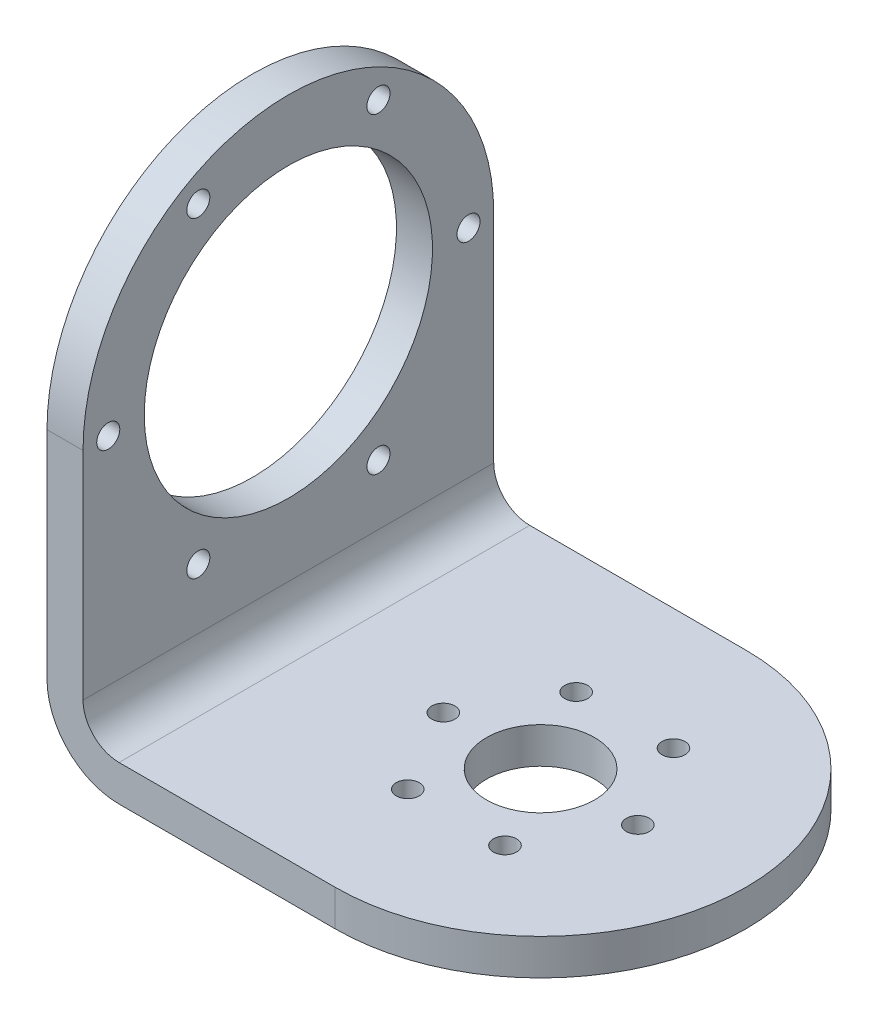
ISO-10303-21;
HEADER;
FILE_DESCRIPTION(('STEP AP214'),'2;1');
FILE_NAME('part.step','',(''),(''),'','','');
FILE_SCHEMA(('AUTOMOTIVE_DESIGN { 1 0 10303 214 1 1 1 1 }'));
ENDSEC;
DATA;
#1=APPLICATION_CONTEXT('core data for automotive mechanical design processes');
#2=APPLICATION_PROTOCOL_DEFINITION('international standard','automotive_design',2000,#1);
#3=PRODUCT_CONTEXT('',#1,'mechanical');
#4=PRODUCT('Part','Part','',(#3));
#5=PRODUCT_RELATED_PRODUCT_CATEGORY('part','',(#4));
#6=PRODUCT_DEFINITION_FORMATION('','',#4);
#7=PRODUCT_DEFINITION_CONTEXT('part definition',#1,'design');
#8=PRODUCT_DEFINITION('design','',#6,#7);
#9=PRODUCT_DEFINITION_SHAPE('','',#8);
#10=(LENGTH_UNIT() NAMED_UNIT(*) SI_UNIT(.MILLI.,.METRE.));
#11=(NAMED_UNIT(*) PLANE_ANGLE_UNIT() SI_UNIT($,.RADIAN.));
#12=(NAMED_UNIT(*) SI_UNIT($,.STERADIAN.) SOLID_ANGLE_UNIT());
#13=UNCERTAINTY_MEASURE_WITH_UNIT(LENGTH_MEASURE(1.E-05),#10,'distance_accuracy_value','');
#14=(GEOMETRIC_REPRESENTATION_CONTEXT(3) GLOBAL_UNCERTAINTY_ASSIGNED_CONTEXT((#13)) GLOBAL_UNIT_ASSIGNED_CONTEXT((#10,
#11,#12)) REPRESENTATION_CONTEXT('',''));
#15=CARTESIAN_POINT('',(0.,0.,0.));
#16=DIRECTION('',(0.,0.,1.));
#17=DIRECTION('',(1.,0.,0.));
#18=AXIS2_PLACEMENT_3D('',#15,#16,#17);
#19=CARTESIAN_POINT('',(0.,5.,28.5));
#20=DIRECTION('',(0.,0.,-1.));
#21=DIRECTION('',(-1.,0.,0.));
#22=AXIS2_PLACEMENT_3D('',#19,#20,#21);
#23=PLANE('',#22);
#24=DIRECTION('',(0.,-1.,0.));
#25=VECTOR('',#24,1.);
#26=CARTESIAN_POINT('',(-40.,5.,28.5));
#27=LINE('',#26,#25);
#28=CARTESIAN_POINT('',(-40.,40.,28.5));
#29=VERTEX_POINT('',#28);
#30=CARTESIAN_POINT('',(-40.,10.,28.5));
#31=VERTEX_POINT('',#30);
#32=EDGE_CURVE('E186',#29,#31,#27,.T.);
#33=ORIENTED_EDGE('',*,*,#32,.T.);
#34=CARTESIAN_POINT('',(-30.,10.,28.5));
#35=DIRECTION('',(0.,0.,-1.));
#36=DIRECTION('',(-1.,0.,0.));
#37=AXIS2_PLACEMENT_3D('',#34,#35,#36);
#38=CIRCLE('',#37,10.);
#39=CARTESIAN_POINT('',(-30.,0.,28.5));
#40=VERTEX_POINT('',#39);
#41=EDGE_CURVE('E205',#31,#40,#38,.F.);
#42=ORIENTED_EDGE('',*,*,#41,.T.);
#43=DIRECTION('',(1.,0.,0.));
#44=VECTOR('',#43,1.);
#45=CARTESIAN_POINT('',(0.,0.,28.5));
#46=LINE('',#45,#44);
#47=CARTESIAN_POINT('',(0.,0.,28.5));
#48=VERTEX_POINT('',#47);
#49=EDGE_CURVE('E177',#40,#48,#46,.T.);
#50=ORIENTED_EDGE('',*,*,#49,.T.);
#51=DIRECTION('',(0.,-1.,0.));
#52=VECTOR('',#51,1.);
#53=CARTESIAN_POINT('',(0.,5.,28.5));
#54=LINE('',#53,#52);
#55=CARTESIAN_POINT('',(0.,5.,28.5));
#56=VERTEX_POINT('',#55);
#57=EDGE_CURVE('E199',#56,#48,#54,.T.);
#58=ORIENTED_EDGE('',*,*,#57,.F.);
#59=DIRECTION('',(1.,0.,0.));
#60=VECTOR('',#59,1.);
#61=CARTESIAN_POINT('',(0.,5.,28.5));
#62=LINE('',#61,#60);
#63=CARTESIAN_POINT('',(-30.,5.,28.5));
#64=VERTEX_POINT('',#63);
#65=EDGE_CURVE('E179',#64,#56,#62,.T.);
#66=ORIENTED_EDGE('',*,*,#65,.F.);
#67=CARTESIAN_POINT('',(-30.,10.,28.5));
#68=DIRECTION('',(0.,0.,-1.));
#69=DIRECTION('',(-1.,0.,0.));
#70=AXIS2_PLACEMENT_3D('',#67,#68,#69);
#71=CIRCLE('',#70,5.);
#72=CARTESIAN_POINT('',(-35.,10.,28.5));
#73=VERTEX_POINT('',#72);
#74=EDGE_CURVE('E11',#64,#73,#71,.T.);
#75=ORIENTED_EDGE('',*,*,#74,.T.);
#76=DIRECTION('',(0.,1.,0.));
#77=VECTOR('',#76,1.);
#78=CARTESIAN_POINT('',(-35.,0.,28.5));
#79=LINE('',#78,#77);
#80=CARTESIAN_POINT('',(-35.,40.,28.5));
#81=VERTEX_POINT('',#80);
#82=EDGE_CURVE('E105',#73,#81,#79,.T.);
#83=ORIENTED_EDGE('',*,*,#82,.T.);
#84=DIRECTION('',(-1.,0.,0.));
#85=VECTOR('',#84,1.);
#86=CARTESIAN_POINT('',(-35.,40.,28.5));
#87=LINE('',#86,#85);
#88=EDGE_CURVE('E108',#81,#29,#87,.T.);
#89=ORIENTED_EDGE('',*,*,#88,.T.);
#90=EDGE_LOOP('',(#33,#42,#50,#58,#66,#75,#83,#89));
#91=FACE_BOUND('',#90,.T.);
#92=ADVANCED_FACE('F41',(#91),#23,.F.);
#93=CARTESIAN_POINT('',(0.,5.,0.));
#94=DIRECTION('',(0.,-1.,0.));
#95=DIRECTION('',(0.,0.,-1.));
#96=AXIS2_PLACEMENT_3D('',#93,#94,#95);
#97=CYLINDRICAL_SURFACE('',#96,28.5);
#98=CARTESIAN_POINT('',(0.,0.,0.));
#99=DIRECTION('',(0.,1.,0.));
#100=DIRECTION('',(0.,0.,1.));
#101=AXIS2_PLACEMENT_3D('',#98,#99,#100);
#102=CIRCLE('',#101,28.5);
#103=CARTESIAN_POINT('',(0.,0.,-28.5));
#104=VERTEX_POINT('',#103);
#105=EDGE_CURVE('E188',#48,#104,#102,.T.);
#106=ORIENTED_EDGE('',*,*,#105,.T.);
#107=DIRECTION('',(0.,-1.,0.));
#108=VECTOR('',#107,1.);
#109=CARTESIAN_POINT('',(0.,5.,-28.5));
#110=LINE('',#109,#108);
#111=CARTESIAN_POINT('',(0.,5.,-28.5));
#112=VERTEX_POINT('',#111);
#113=EDGE_CURVE('E196',#112,#104,#110,.T.);
#114=ORIENTED_EDGE('',*,*,#113,.F.);
#115=CARTESIAN_POINT('',(0.,5.,0.));
#116=DIRECTION('',(0.,1.,0.));
#117=DIRECTION('',(0.,0.,1.));
#118=AXIS2_PLACEMENT_3D('',#115,#116,#117);
#119=CIRCLE('',#118,28.5);
#120=EDGE_CURVE('E181',#56,#112,#119,.T.);
#121=ORIENTED_EDGE('',*,*,#120,.F.);
#122=ORIENTED_EDGE('',*,*,#57,.T.);
#123=EDGE_LOOP('',(#106,#114,#121,#122));
#124=FACE_BOUND('',#123,.T.);
#125=ADVANCED_FACE('F232',(#124),#97,.T.);
#126=CARTESIAN_POINT('',(0.,5.,-28.5));
#127=DIRECTION('',(0.,0.,1.));
#128=DIRECTION('',(1.,0.,0.));
#129=AXIS2_PLACEMENT_3D('',#126,#127,#128);
#130=PLANE('',#129);
#131=DIRECTION('',(-1.,0.,0.));
#132=VECTOR('',#131,1.);
#133=CARTESIAN_POINT('',(0.,0.,-28.5));
#134=LINE('',#133,#132);
#135=CARTESIAN_POINT('',(-30.,0.,-28.5));
#136=VERTEX_POINT('',#135);
#137=EDGE_CURVE('E182',#104,#136,#134,.T.);
#138=ORIENTED_EDGE('',*,*,#137,.T.);
#139=CARTESIAN_POINT('',(-30.,10.,-28.5));
#140=DIRECTION('',(0.,0.,1.));
#141=DIRECTION('',(1.,0.,0.));
#142=AXIS2_PLACEMENT_3D('',#139,#140,#141);
#143=CIRCLE('',#142,10.);
#144=CARTESIAN_POINT('',(-40.,10.,-28.5));
#145=VERTEX_POINT('',#144);
#146=EDGE_CURVE('E209',#136,#145,#143,.F.);
#147=ORIENTED_EDGE('',*,*,#146,.T.);
#148=DIRECTION('',(0.,-1.,0.));
#149=VECTOR('',#148,1.);
#150=CARTESIAN_POINT('',(-40.,5.,-28.5));
#151=LINE('',#150,#149);
#152=CARTESIAN_POINT('',(-40.,40.,-28.5));
#153=VERTEX_POINT('',#152);
#154=EDGE_CURVE('E193',#153,#145,#151,.T.);
#155=ORIENTED_EDGE('',*,*,#154,.F.);
#156=DIRECTION('',(-1.,0.,0.));
#157=VECTOR('',#156,1.);
#158=CARTESIAN_POINT('',(-35.,40.,-28.5));
#159=LINE('',#158,#157);
#160=CARTESIAN_POINT('',(-35.,40.,-28.5));
#161=VERTEX_POINT('',#160);
#162=EDGE_CURVE('E124',#161,#153,#159,.T.);
#163=ORIENTED_EDGE('',*,*,#162,.F.);
#164=DIRECTION('',(0.,-1.,0.));
#165=VECTOR('',#164,1.);
#166=CARTESIAN_POINT('',(-35.,0.,-28.5));
#167=LINE('',#166,#165);
#168=CARTESIAN_POINT('',(-35.,10.,-28.5));
#169=VERTEX_POINT('',#168);
#170=EDGE_CURVE('E130',#161,#169,#167,.T.);
#171=ORIENTED_EDGE('',*,*,#170,.T.);
#172=CARTESIAN_POINT('',(-30.,10.,-28.5));
#173=DIRECTION('',(0.,0.,1.));
#174=DIRECTION('',(1.,0.,0.));
#175=AXIS2_PLACEMENT_3D('',#172,#173,#174);
#176=CIRCLE('',#175,5.);
#177=CARTESIAN_POINT('',(-30.,5.,-28.5));
#178=VERTEX_POINT('',#177);
#179=EDGE_CURVE('E49',#169,#178,#176,.T.);
#180=ORIENTED_EDGE('',*,*,#179,.T.);
#181=DIRECTION('',(-1.,0.,0.));
#182=VECTOR('',#181,1.);
#183=CARTESIAN_POINT('',(0.,5.,-28.5));
#184=LINE('',#183,#182);
#185=EDGE_CURVE('E184',#112,#178,#184,.T.);
#186=ORIENTED_EDGE('',*,*,#185,.F.);
#187=ORIENTED_EDGE('',*,*,#113,.T.);
#188=EDGE_LOOP('',(#138,#147,#155,#163,#171,#180,#186,#187));
#189=FACE_BOUND('',#188,.T.);
#190=ADVANCED_FACE('F214',(#189),#130,.F.);
#191=CARTESIAN_POINT('',(-40.,5.,0.));
#192=DIRECTION('',(1.,0.,0.));
#193=DIRECTION('',(0.,0.,-1.));
#194=AXIS2_PLACEMENT_3D('',#191,#192,#193);
#195=PLANE('',#194);
#196=ORIENTED_EDGE('',*,*,#154,.T.);
#197=DIRECTION('',(0.,0.,1.));
#198=VECTOR('',#197,1.);
#199=CARTESIAN_POINT('',(-40.,10.,0.));
#200=LINE('',#199,#198);
#201=EDGE_CURVE('E202',#145,#31,#200,.T.);
#202=ORIENTED_EDGE('',*,*,#201,.T.);
#203=ORIENTED_EDGE('',*,*,#32,.F.);
#204=CARTESIAN_POINT('',(-40.,40.,0.));
#205=DIRECTION('',(-1.,0.,0.));
#206=DIRECTION('',(0.,0.,1.));
#207=AXIS2_PLACEMENT_3D('',#204,#205,#206);
#208=CIRCLE('',#207,28.5);
#209=EDGE_CURVE('E123',#29,#153,#208,.T.);
#210=ORIENTED_EDGE('',*,*,#209,.T.);
#211=EDGE_LOOP('',(#196,#202,#203,#210));
#212=FACE_BOUND('',#211,.T.);
#213=CARTESIAN_POINT('',(-40.,39.9999999999999,-24.9999999999994));
#214=DIRECTION('',(-1.,0.,0.));
#215=DIRECTION('',(0.,0.,1.));
#216=AXIS2_PLACEMENT_3D('',#213,#214,#215);
#217=CIRCLE('',#216,1.6);
#218=CARTESIAN_POINT('',(-40.,39.9999999999999,-23.3999999999994));
#219=VERTEX_POINT('',#218);
#220=EDGE_CURVE('E156',#219,#219,#217,.T.);
#221=ORIENTED_EDGE('',*,*,#220,.F.);
#222=EDGE_LOOP('',(#221));
#223=FACE_BOUND('',#222,.T.);
#224=CARTESIAN_POINT('',(-40.,18.3493649053891,-12.4999999999989));
#225=DIRECTION('',(-1.,0.,0.));
#226=DIRECTION('',(0.,0.,1.));
#227=AXIS2_PLACEMENT_3D('',#224,#225,#226);
#228=CIRCLE('',#227,1.60000000000001);
#229=CARTESIAN_POINT('',(-40.,18.3493649053891,-10.8999999999989));
#230=VERTEX_POINT('',#229);
#231=EDGE_CURVE('E160',#230,#230,#228,.T.);
#232=ORIENTED_EDGE('',*,*,#231,.F.);
#233=EDGE_LOOP('',(#232));
#234=FACE_BOUND('',#233,.T.);
#235=CARTESIAN_POINT('',(-40.,18.3493649053897,12.5000000000011));
#236=DIRECTION('',(-1.,0.,0.));
#237=DIRECTION('',(0.,0.,1.));
#238=AXIS2_PLACEMENT_3D('',#235,#236,#237);
#239=CIRCLE('',#238,1.6);
#240=CARTESIAN_POINT('',(-40.,18.3493649053897,14.1000000000011));
#241=VERTEX_POINT('',#240);
#242=EDGE_CURVE('E163',#241,#241,#239,.T.);
#243=ORIENTED_EDGE('',*,*,#242,.F.);
#244=EDGE_LOOP('',(#243));
#245=FACE_BOUND('',#244,.T.);
#246=CARTESIAN_POINT('',(-40.,40.000000000001,25.0000000000006));
#247=DIRECTION('',(-1.,0.,0.));
#248=DIRECTION('',(0.,0.,1.));
#249=AXIS2_PLACEMENT_3D('',#246,#247,#248);
#250=CIRCLE('',#249,1.6);
#251=CARTESIAN_POINT('',(-40.,40.000000000001,26.6000000000006));
#252=VERTEX_POINT('',#251);
#253=EDGE_CURVE('E166',#252,#252,#250,.T.);
#254=ORIENTED_EDGE('',*,*,#253,.F.);
#255=EDGE_LOOP('',(#254));
#256=FACE_BOUND('',#255,.T.);
#257=CARTESIAN_POINT('',(-40.,61.6506350946116,12.5));
#258=DIRECTION('',(-1.,0.,0.));
#259=DIRECTION('',(0.,0.,1.));
#260=AXIS2_PLACEMENT_3D('',#257,#258,#259);
#261=CIRCLE('',#260,1.6);
#262=CARTESIAN_POINT('',(-40.,61.6506350946116,14.1));
#263=VERTEX_POINT('',#262);
#264=EDGE_CURVE('E169',#263,#263,#261,.T.);
#265=ORIENTED_EDGE('',*,*,#264,.F.);
#266=EDGE_LOOP('',(#265));
#267=FACE_BOUND('',#266,.T.);
#268=CARTESIAN_POINT('',(-40.,61.6506350946109,-12.5));
#269=DIRECTION('',(-1.,0.,0.));
#270=DIRECTION('',(0.,0.,1.));
#271=AXIS2_PLACEMENT_3D('',#268,#269,#270);
#272=CIRCLE('',#271,1.6);
#273=CARTESIAN_POINT('',(-40.,61.6506350946109,-10.9));
#274=VERTEX_POINT('',#273);
#275=EDGE_CURVE('E172',#274,#274,#272,.T.);
#276=ORIENTED_EDGE('',*,*,#275,.F.);
#277=EDGE_LOOP('',(#276));
#278=FACE_BOUND('',#277,.T.);
#279=CARTESIAN_POINT('',(-40.,40.,0.));
#280=DIRECTION('',(-1.,0.,0.));
#281=DIRECTION('',(0.,0.,1.));
#282=AXIS2_PLACEMENT_3D('',#279,#280,#281);
#283=CIRCLE('',#282,20.);
#284=CARTESIAN_POINT('',(-40.,40.,20.));
#285=VERTEX_POINT('',#284);
#286=EDGE_CURVE('E116',#285,#285,#283,.T.);
#287=ORIENTED_EDGE('',*,*,#286,.F.);
#288=EDGE_LOOP('',(#287));
#289=FACE_BOUND('',#288,.T.);
#290=ADVANCED_FACE('F216',(#212,#223,#234,#245,#256,#267,#278,#289),#195,.F.);
#291=CARTESIAN_POINT('',(0.,5.,0.));
#292=DIRECTION('',(0.,1.,0.));
#293=DIRECTION('',(0.,0.,1.));
#294=AXIS2_PLACEMENT_3D('',#291,#292,#293);
#295=PLANE('',#294);
#296=CARTESIAN_POINT('',(13.5,5.,0.));
#297=DIRECTION('',(0.,1.,0.));
#298=DIRECTION('',(0.,0.,1.));
#299=AXIS2_PLACEMENT_3D('',#296,#297,#298);
#300=CIRCLE('',#299,1.6);
#301=CARTESIAN_POINT('',(13.5,5.,1.6));
#302=VERTEX_POINT('',#301);
#303=EDGE_CURVE('E321',#302,#302,#300,.T.);
#304=ORIENTED_EDGE('',*,*,#303,.F.);
#305=EDGE_LOOP('',(#304));
#306=FACE_BOUND('',#305,.T.);
#307=CARTESIAN_POINT('',(-13.5,5.,0.));
#308=DIRECTION('',(0.,1.,0.));
#309=DIRECTION('',(0.,0.,1.));
#310=AXIS2_PLACEMENT_3D('',#307,#308,#309);
#311=CIRCLE('',#310,1.6);
#312=CARTESIAN_POINT('',(-13.5,5.,1.59999999999991));
#313=VERTEX_POINT('',#312);
#314=EDGE_CURVE('E339',#313,#313,#311,.T.);
#315=ORIENTED_EDGE('',*,*,#314,.F.);
#316=EDGE_LOOP('',(#315));
#317=FACE_BOUND('',#316,.T.);
#318=CARTESIAN_POINT('',(-6.75000000000005,5.,11.6913429510899));
#319=DIRECTION('',(0.,1.,0.));
#320=DIRECTION('',(0.,0.,1.));
#321=AXIS2_PLACEMENT_3D('',#318,#319,#320);
#322=CIRCLE('',#321,1.6);
#323=CARTESIAN_POINT('',(-6.75000000000005,5.,13.2913429510899));
#324=VERTEX_POINT('',#323);
#325=EDGE_CURVE('E333',#324,#324,#322,.T.);
#326=ORIENTED_EDGE('',*,*,#325,.F.);
#327=EDGE_LOOP('',(#326));
#328=FACE_BOUND('',#327,.T.);
#329=CARTESIAN_POINT('',(6.74999999999997,5.,11.6913429510899));
#330=DIRECTION('',(0.,1.,0.));
#331=DIRECTION('',(0.,0.,1.));
#332=AXIS2_PLACEMENT_3D('',#329,#330,#331);
#333=CIRCLE('',#332,1.6);
#334=CARTESIAN_POINT('',(6.74999999999997,5.,13.2913429510899));
#335=VERTEX_POINT('',#334);
#336=EDGE_CURVE('E332',#335,#335,#333,.T.);
#337=ORIENTED_EDGE('',*,*,#336,.F.);
#338=EDGE_LOOP('',(#337));
#339=FACE_BOUND('',#338,.T.);
#340=CARTESIAN_POINT('',(0.,5.,0.));
#341=DIRECTION('',(0.,1.,0.));
#342=DIRECTION('',(0.,0.,1.));
#343=AXIS2_PLACEMENT_3D('',#340,#341,#342);
#344=CIRCLE('',#343,7.5);
#345=CARTESIAN_POINT('',(0.,5.,7.5));
#346=VERTEX_POINT('',#345);
#347=EDGE_CURVE('E326',#346,#346,#344,.T.);
#348=ORIENTED_EDGE('',*,*,#347,.F.);
#349=EDGE_LOOP('',(#348));
#350=FACE_BOUND('',#349,.T.);
#351=CARTESIAN_POINT('',(-6.74999999999989,5.,-11.69134295109));
#352=DIRECTION('',(0.,1.,0.));
#353=DIRECTION('',(0.,0.,1.));
#354=AXIS2_PLACEMENT_3D('',#351,#352,#353);
#355=CIRCLE('',#354,1.6);
#356=CARTESIAN_POINT('',(-6.74999999999989,5.,-10.09134295109));
#357=VERTEX_POINT('',#356);
#358=EDGE_CURVE('E352',#357,#357,#355,.T.);
#359=ORIENTED_EDGE('',*,*,#358,.F.);
#360=EDGE_LOOP('',(#359));
#361=FACE_BOUND('',#360,.T.);
#362=CARTESIAN_POINT('',(6.75000000000014,5.,-11.6913429510898));
#363=DIRECTION('',(0.,1.,0.));
#364=DIRECTION('',(0.,0.,1.));
#365=AXIS2_PLACEMENT_3D('',#362,#363,#364);
#366=CIRCLE('',#365,1.6);
#367=CARTESIAN_POINT('',(6.75000000000014,5.,-10.0913429510898));
#368=VERTEX_POINT('',#367);
#369=EDGE_CURVE('E357',#368,#368,#366,.T.);
#370=ORIENTED_EDGE('',*,*,#369,.F.);
#371=EDGE_LOOP('',(#370));
#372=FACE_BOUND('',#371,.T.);
#373=ORIENTED_EDGE('',*,*,#185,.T.);
#374=DIRECTION('',(0.,0.,-1.));
#375=VECTOR('',#374,1.);
#376=CARTESIAN_POINT('',(-30.,5.,0.));
#377=LINE('',#376,#375);
#378=EDGE_CURVE('E62',#178,#64,#377,.F.);
#379=ORIENTED_EDGE('',*,*,#378,.T.);
#380=ORIENTED_EDGE('',*,*,#65,.T.);
#381=ORIENTED_EDGE('',*,*,#120,.T.);
#382=EDGE_LOOP('',(#373,#379,#380,#381));
#383=FACE_BOUND('',#382,.T.);
#384=ADVANCED_FACE('F253',(#306,#317,#328,#339,#350,#361,#372,#383),#295,.T.);
#385=CARTESIAN_POINT('',(0.,0.,0.));
#386=DIRECTION('',(0.,1.,0.));
#387=DIRECTION('',(0.,0.,1.));
#388=AXIS2_PLACEMENT_3D('',#385,#386,#387);
#389=PLANE('',#388);
#390=CARTESIAN_POINT('',(13.5,0.,0.));
#391=DIRECTION('',(0.,1.,0.));
#392=DIRECTION('',(0.,0.,1.));
#393=AXIS2_PLACEMENT_3D('',#390,#391,#392);
#394=CIRCLE('',#393,1.6);
#395=CARTESIAN_POINT('',(13.5,0.,1.6));
#396=VERTEX_POINT('',#395);
#397=EDGE_CURVE('E157',#396,#396,#394,.T.);
#398=ORIENTED_EDGE('',*,*,#397,.T.);
#399=EDGE_LOOP('',(#398));
#400=FACE_BOUND('',#399,.T.);
#401=CARTESIAN_POINT('',(-13.5,0.,0.));
#402=DIRECTION('',(0.,1.,0.));
#403=DIRECTION('',(0.,0.,1.));
#404=AXIS2_PLACEMENT_3D('',#401,#402,#403);
#405=CIRCLE('',#404,1.6);
#406=CARTESIAN_POINT('',(-13.5,0.,1.59999999999991));
#407=VERTEX_POINT('',#406);
#408=EDGE_CURVE('E336',#407,#407,#405,.T.);
#409=ORIENTED_EDGE('',*,*,#408,.T.);
#410=EDGE_LOOP('',(#409));
#411=FACE_BOUND('',#410,.T.);
#412=CARTESIAN_POINT('',(-6.75000000000005,0.,11.6913429510899));
#413=DIRECTION('',(0.,1.,0.));
#414=DIRECTION('',(0.,0.,1.));
#415=AXIS2_PLACEMENT_3D('',#412,#413,#414);
#416=CIRCLE('',#415,1.6);
#417=CARTESIAN_POINT('',(-6.75000000000005,0.,13.2913429510899));
#418=VERTEX_POINT('',#417);
#419=EDGE_CURVE('E329',#418,#418,#416,.T.);
#420=ORIENTED_EDGE('',*,*,#419,.T.);
#421=EDGE_LOOP('',(#420));
#422=FACE_BOUND('',#421,.T.);
#423=CARTESIAN_POINT('',(6.74999999999997,0.,11.6913429510899));
#424=DIRECTION('',(0.,1.,0.));
#425=DIRECTION('',(0.,0.,1.));
#426=AXIS2_PLACEMENT_3D('',#423,#424,#425);
#427=CIRCLE('',#426,1.6);
#428=CARTESIAN_POINT('',(6.74999999999997,0.,13.2913429510899));
#429=VERTEX_POINT('',#428);
#430=EDGE_CURVE('E345',#429,#429,#427,.T.);
#431=ORIENTED_EDGE('',*,*,#430,.T.);
#432=EDGE_LOOP('',(#431));
#433=FACE_BOUND('',#432,.T.);
#434=CARTESIAN_POINT('',(0.,0.,0.));
#435=DIRECTION('',(0.,1.,0.));
#436=DIRECTION('',(0.,0.,1.));
#437=AXIS2_PLACEMENT_3D('',#434,#435,#436);
#438=CIRCLE('',#437,7.5);
#439=CARTESIAN_POINT('',(0.,0.,7.5));
#440=VERTEX_POINT('',#439);
#441=EDGE_CURVE('E322',#440,#440,#438,.T.);
#442=ORIENTED_EDGE('',*,*,#441,.T.);
#443=EDGE_LOOP('',(#442));
#444=FACE_BOUND('',#443,.T.);
#445=CARTESIAN_POINT('',(-6.74999999999989,0.,-11.69134295109));
#446=DIRECTION('',(0.,1.,0.));
#447=DIRECTION('',(0.,0.,1.));
#448=AXIS2_PLACEMENT_3D('',#445,#446,#447);
#449=CIRCLE('',#448,1.6);
#450=CARTESIAN_POINT('',(-6.74999999999989,0.,-10.09134295109));
#451=VERTEX_POINT('',#450);
#452=EDGE_CURVE('E341',#451,#451,#449,.T.);
#453=ORIENTED_EDGE('',*,*,#452,.T.);
#454=EDGE_LOOP('',(#453));
#455=FACE_BOUND('',#454,.T.);
#456=CARTESIAN_POINT('',(6.75000000000014,0.,-11.6913429510898));
#457=DIRECTION('',(0.,1.,0.));
#458=DIRECTION('',(0.,0.,1.));
#459=AXIS2_PLACEMENT_3D('',#456,#457,#458);
#460=CIRCLE('',#459,1.6);
#461=CARTESIAN_POINT('',(6.75000000000014,0.,-10.0913429510898));
#462=VERTEX_POINT('',#461);
#463=EDGE_CURVE('E355',#462,#462,#460,.T.);
#464=ORIENTED_EDGE('',*,*,#463,.T.);
#465=EDGE_LOOP('',(#464));
#466=FACE_BOUND('',#465,.T.);
#467=ORIENTED_EDGE('',*,*,#49,.F.);
#468=DIRECTION('',(0.,0.,1.));
#469=VECTOR('',#468,1.);
#470=CARTESIAN_POINT('',(-30.,0.,0.));
#471=LINE('',#470,#469);
#472=EDGE_CURVE('E207',#40,#136,#471,.F.);
#473=ORIENTED_EDGE('',*,*,#472,.T.);
#474=ORIENTED_EDGE('',*,*,#137,.F.);
#475=ORIENTED_EDGE('',*,*,#105,.F.);
#476=EDGE_LOOP('',(#467,#473,#474,#475));
#477=FACE_BOUND('',#476,.T.);
#478=ADVANCED_FACE('F225',(#400,#411,#422,#433,#444,#455,#466,#477),#389,.F.);
#479=CARTESIAN_POINT('',(-35.,61.6506350946109,-12.5));
#480=DIRECTION('',(-1.,0.,0.));
#481=DIRECTION('',(0.,0.,1.));
#482=AXIS2_PLACEMENT_3D('',#479,#480,#481);
#483=CYLINDRICAL_SURFACE('',#482,1.6);
#484=CARTESIAN_POINT('',(-35.,61.6506350946109,-12.5));
#485=DIRECTION('',(-1.,0.,0.));
#486=DIRECTION('',(0.,0.,1.));
#487=AXIS2_PLACEMENT_3D('',#484,#485,#486);
#488=CIRCLE('',#487,1.6);
#489=CARTESIAN_POINT('',(-35.,61.6506350946109,-10.9));
#490=VERTEX_POINT('',#489);
#491=EDGE_CURVE('E150',#490,#490,#488,.T.);
#492=ORIENTED_EDGE('',*,*,#491,.F.);
#493=EDGE_LOOP('',(#492));
#494=FACE_BOUND('',#493,.T.);
#495=ORIENTED_EDGE('',*,*,#275,.T.);
#496=EDGE_LOOP('',(#495));
#497=FACE_BOUND('',#496,.T.);
#498=ADVANCED_FACE('F256',(#494,#497),#483,.F.);
#499=CARTESIAN_POINT('',(-35.,61.6506350946116,12.5));
#500=DIRECTION('',(-1.,0.,0.));
#501=DIRECTION('',(0.,0.,1.));
#502=AXIS2_PLACEMENT_3D('',#499,#500,#501);
#503=CYLINDRICAL_SURFACE('',#502,1.6);
#504=CARTESIAN_POINT('',(-35.,61.6506350946116,12.5));
#505=DIRECTION('',(-1.,0.,0.));
#506=DIRECTION('',(0.,0.,1.));
#507=AXIS2_PLACEMENT_3D('',#504,#505,#506);
#508=CIRCLE('',#507,1.6);
#509=CARTESIAN_POINT('',(-35.,61.6506350946116,14.1));
#510=VERTEX_POINT('',#509);
#511=EDGE_CURVE('E147',#510,#510,#508,.T.);
#512=ORIENTED_EDGE('',*,*,#511,.F.);
#513=EDGE_LOOP('',(#512));
#514=FACE_BOUND('',#513,.T.);
#515=ORIENTED_EDGE('',*,*,#264,.T.);
#516=EDGE_LOOP('',(#515));
#517=FACE_BOUND('',#516,.T.);
#518=ADVANCED_FACE('F279',(#514,#517),#503,.F.);
#519=CARTESIAN_POINT('',(-35.,40.000000000001,25.0000000000006));
#520=DIRECTION('',(-1.,0.,0.));
#521=DIRECTION('',(0.,0.,1.));
#522=AXIS2_PLACEMENT_3D('',#519,#520,#521);
#523=CYLINDRICAL_SURFACE('',#522,1.6);
#524=CARTESIAN_POINT('',(-35.,40.000000000001,25.0000000000006));
#525=DIRECTION('',(-1.,0.,0.));
#526=DIRECTION('',(0.,0.,1.));
#527=AXIS2_PLACEMENT_3D('',#524,#525,#526);
#528=CIRCLE('',#527,1.6);
#529=CARTESIAN_POINT('',(-35.,40.000000000001,26.6000000000006));
#530=VERTEX_POINT('',#529);
#531=EDGE_CURVE('E144',#530,#530,#528,.T.);
#532=ORIENTED_EDGE('',*,*,#531,.F.);
#533=EDGE_LOOP('',(#532));
#534=FACE_BOUND('',#533,.T.);
#535=ORIENTED_EDGE('',*,*,#253,.T.);
#536=EDGE_LOOP('',(#535));
#537=FACE_BOUND('',#536,.T.);
#538=ADVANCED_FACE('F275',(#534,#537),#523,.F.);
#539=CARTESIAN_POINT('',(-35.,18.3493649053897,12.5000000000011));
#540=DIRECTION('',(-1.,0.,0.));
#541=DIRECTION('',(0.,0.,1.));
#542=AXIS2_PLACEMENT_3D('',#539,#540,#541);
#543=CYLINDRICAL_SURFACE('',#542,1.6);
#544=CARTESIAN_POINT('',(-35.,18.3493649053897,12.5000000000011));
#545=DIRECTION('',(-1.,0.,0.));
#546=DIRECTION('',(0.,0.,1.));
#547=AXIS2_PLACEMENT_3D('',#544,#545,#546);
#548=CIRCLE('',#547,1.6);
#549=CARTESIAN_POINT('',(-35.,18.3493649053897,14.1000000000011));
#550=VERTEX_POINT('',#549);
#551=EDGE_CURVE('E141',#550,#550,#548,.T.);
#552=ORIENTED_EDGE('',*,*,#551,.F.);
#553=EDGE_LOOP('',(#552));
#554=FACE_BOUND('',#553,.T.);
#555=ORIENTED_EDGE('',*,*,#242,.T.);
#556=EDGE_LOOP('',(#555));
#557=FACE_BOUND('',#556,.T.);
#558=ADVANCED_FACE('F271',(#554,#557),#543,.F.);
#559=CARTESIAN_POINT('',(-35.,18.3493649053891,-12.4999999999989));
#560=DIRECTION('',(-1.,0.,0.));
#561=DIRECTION('',(0.,0.,1.));
#562=AXIS2_PLACEMENT_3D('',#559,#560,#561);
#563=CYLINDRICAL_SURFACE('',#562,1.60000000000001);
#564=CARTESIAN_POINT('',(-35.,18.3493649053891,-12.4999999999989));
#565=DIRECTION('',(-1.,0.,0.));
#566=DIRECTION('',(0.,0.,1.));
#567=AXIS2_PLACEMENT_3D('',#564,#565,#566);
#568=CIRCLE('',#567,1.60000000000001);
#569=CARTESIAN_POINT('',(-35.,18.3493649053891,-10.8999999999989));
#570=VERTEX_POINT('',#569);
#571=EDGE_CURVE('E138',#570,#570,#568,.T.);
#572=ORIENTED_EDGE('',*,*,#571,.F.);
#573=EDGE_LOOP('',(#572));
#574=FACE_BOUND('',#573,.T.);
#575=ORIENTED_EDGE('',*,*,#231,.T.);
#576=EDGE_LOOP('',(#575));
#577=FACE_BOUND('',#576,.T.);
#578=ADVANCED_FACE('F267',(#574,#577),#563,.F.);
#579=CARTESIAN_POINT('',(-35.,39.9999999999999,-24.9999999999994));
#580=DIRECTION('',(-1.,0.,0.));
#581=DIRECTION('',(0.,0.,1.));
#582=AXIS2_PLACEMENT_3D('',#579,#580,#581);
#583=CYLINDRICAL_SURFACE('',#582,1.6);
#584=CARTESIAN_POINT('',(-35.,39.9999999999999,-24.9999999999994));
#585=DIRECTION('',(-1.,0.,0.));
#586=DIRECTION('',(0.,0.,1.));
#587=AXIS2_PLACEMENT_3D('',#584,#585,#586);
#588=CIRCLE('',#587,1.6);
#589=CARTESIAN_POINT('',(-35.,39.9999999999999,-23.3999999999994));
#590=VERTEX_POINT('',#589);
#591=EDGE_CURVE('E132',#590,#590,#588,.T.);
#592=ORIENTED_EDGE('',*,*,#591,.F.);
#593=EDGE_LOOP('',(#592));
#594=FACE_BOUND('',#593,.T.);
#595=ORIENTED_EDGE('',*,*,#220,.T.);
#596=EDGE_LOOP('',(#595));
#597=FACE_BOUND('',#596,.T.);
#598=ADVANCED_FACE('F264',(#594,#597),#583,.F.);
#599=CARTESIAN_POINT('',(-35.,40.,0.));
#600=DIRECTION('',(-1.,0.,0.));
#601=DIRECTION('',(0.,0.,1.));
#602=AXIS2_PLACEMENT_3D('',#599,#600,#601);
#603=CYLINDRICAL_SURFACE('',#602,28.5);
#604=ORIENTED_EDGE('',*,*,#209,.F.);
#605=ORIENTED_EDGE('',*,*,#88,.F.);
#606=CARTESIAN_POINT('',(-35.,40.,0.));
#607=DIRECTION('',(-1.,0.,0.));
#608=DIRECTION('',(0.,0.,1.));
#609=AXIS2_PLACEMENT_3D('',#606,#607,#608);
#610=CIRCLE('',#609,28.5);
#611=EDGE_CURVE('E115',#81,#161,#610,.T.);
#612=ORIENTED_EDGE('',*,*,#611,.T.);
#613=ORIENTED_EDGE('',*,*,#162,.T.);
#614=EDGE_LOOP('',(#604,#605,#612,#613));
#615=FACE_BOUND('',#614,.T.);
#616=ADVANCED_FACE('F120',(#615),#603,.T.);
#617=CARTESIAN_POINT('',(-35.,40.,0.));
#618=DIRECTION('',(-1.,0.,0.));
#619=DIRECTION('',(0.,0.,1.));
#620=AXIS2_PLACEMENT_3D('',#617,#618,#619);
#621=CYLINDRICAL_SURFACE('',#620,20.);
#622=CARTESIAN_POINT('',(-35.,40.,0.));
#623=DIRECTION('',(-1.,0.,0.));
#624=DIRECTION('',(0.,0.,1.));
#625=AXIS2_PLACEMENT_3D('',#622,#623,#624);
#626=CIRCLE('',#625,20.);
#627=CARTESIAN_POINT('',(-35.,40.,20.));
#628=VERTEX_POINT('',#627);
#629=EDGE_CURVE('E125',#628,#628,#626,.T.);
#630=ORIENTED_EDGE('',*,*,#629,.F.);
#631=EDGE_LOOP('',(#630));
#632=FACE_BOUND('',#631,.T.);
#633=ORIENTED_EDGE('',*,*,#286,.T.);
#634=EDGE_LOOP('',(#633));
#635=FACE_BOUND('',#634,.T.);
#636=ADVANCED_FACE('F263',(#632,#635),#621,.F.);
#637=CARTESIAN_POINT('',(-35.,0.,0.));
#638=DIRECTION('',(-1.,0.,0.));
#639=DIRECTION('',(0.,0.,1.));
#640=AXIS2_PLACEMENT_3D('',#637,#638,#639);
#641=PLANE('',#640);
#642=ORIENTED_EDGE('',*,*,#82,.F.);
#643=DIRECTION('',(0.,0.,-1.));
#644=VECTOR('',#643,1.);
#645=CARTESIAN_POINT('',(-35.,10.,0.));
#646=LINE('',#645,#644);
#647=EDGE_CURVE('E211',#73,#169,#646,.T.);
#648=ORIENTED_EDGE('',*,*,#647,.T.);
#649=ORIENTED_EDGE('',*,*,#170,.F.);
#650=ORIENTED_EDGE('',*,*,#611,.F.);
#651=EDGE_LOOP('',(#642,#648,#649,#650));
#652=FACE_BOUND('',#651,.T.);
#653=ORIENTED_EDGE('',*,*,#591,.T.);
#654=EDGE_LOOP('',(#653));
#655=FACE_BOUND('',#654,.T.);
#656=ORIENTED_EDGE('',*,*,#571,.T.);
#657=EDGE_LOOP('',(#656));
#658=FACE_BOUND('',#657,.T.);
#659=ORIENTED_EDGE('',*,*,#551,.T.);
#660=EDGE_LOOP('',(#659));
#661=FACE_BOUND('',#660,.T.);
#662=ORIENTED_EDGE('',*,*,#531,.T.);
#663=EDGE_LOOP('',(#662));
#664=FACE_BOUND('',#663,.T.);
#665=ORIENTED_EDGE('',*,*,#511,.T.);
#666=EDGE_LOOP('',(#665));
#667=FACE_BOUND('',#666,.T.);
#668=ORIENTED_EDGE('',*,*,#491,.T.);
#669=EDGE_LOOP('',(#668));
#670=FACE_BOUND('',#669,.T.);
#671=ORIENTED_EDGE('',*,*,#629,.T.);
#672=EDGE_LOOP('',(#671));
#673=FACE_BOUND('',#672,.T.);
#674=ADVANCED_FACE('F128',(#652,#655,#658,#661,#664,#667,#670,#673),#641,.F.);
#675=CARTESIAN_POINT('',(-30.,10.,0.));
#676=DIRECTION('',(0.,0.,1.));
#677=DIRECTION('',(1.,0.,0.));
#678=AXIS2_PLACEMENT_3D('',#675,#676,#677);
#679=CYLINDRICAL_SURFACE('',#678,10.);
#680=ORIENTED_EDGE('',*,*,#146,.F.);
#681=ORIENTED_EDGE('',*,*,#472,.F.);
#682=ORIENTED_EDGE('',*,*,#41,.F.);
#683=ORIENTED_EDGE('',*,*,#201,.F.);
#684=EDGE_LOOP('',(#680,#681,#682,#683));
#685=FACE_BOUND('',#684,.T.);
#686=ADVANCED_FACE('F228',(#685),#679,.T.);
#687=CARTESIAN_POINT('',(-30.,10.,0.));
#688=DIRECTION('',(0.,0.,-1.));
#689=DIRECTION('',(-1.,0.,0.));
#690=AXIS2_PLACEMENT_3D('',#687,#688,#689);
#691=CYLINDRICAL_SURFACE('',#690,5.);
#692=ORIENTED_EDGE('',*,*,#74,.F.);
#693=ORIENTED_EDGE('',*,*,#378,.F.);
#694=ORIENTED_EDGE('',*,*,#179,.F.);
#695=ORIENTED_EDGE('',*,*,#647,.F.);
#696=EDGE_LOOP('',(#692,#693,#694,#695));
#697=FACE_BOUND('',#696,.T.);
#698=ADVANCED_FACE('F43',(#697),#691,.F.);
#699=CARTESIAN_POINT('',(6.75000000000014,0.,-11.6913429510898));
#700=DIRECTION('',(0.,1.,0.));
#701=DIRECTION('',(0.,0.,1.));
#702=AXIS2_PLACEMENT_3D('',#699,#700,#701);
#703=CYLINDRICAL_SURFACE('',#702,1.6);
#704=ORIENTED_EDGE('',*,*,#463,.F.);
#705=EDGE_LOOP('',(#704));
#706=FACE_BOUND('',#705,.T.);
#707=ORIENTED_EDGE('',*,*,#369,.T.);
#708=EDGE_LOOP('',(#707));
#709=FACE_BOUND('',#708,.T.);
#710=ADVANCED_FACE('F234',(#706,#709),#703,.F.);
#711=CARTESIAN_POINT('',(-6.74999999999989,0.,-11.69134295109));
#712=DIRECTION('',(0.,1.,0.));
#713=DIRECTION('',(0.,0.,1.));
#714=AXIS2_PLACEMENT_3D('',#711,#712,#713);
#715=CYLINDRICAL_SURFACE('',#714,1.6);
#716=ORIENTED_EDGE('',*,*,#452,.F.);
#717=EDGE_LOOP('',(#716));
#718=FACE_BOUND('',#717,.T.);
#719=ORIENTED_EDGE('',*,*,#358,.T.);
#720=EDGE_LOOP('',(#719));
#721=FACE_BOUND('',#720,.T.);
#722=ADVANCED_FACE('F239',(#718,#721),#715,.F.);
#723=CARTESIAN_POINT('',(0.,0.,0.));
#724=DIRECTION('',(0.,1.,0.));
#725=DIRECTION('',(0.,0.,1.));
#726=AXIS2_PLACEMENT_3D('',#723,#724,#725);
#727=CYLINDRICAL_SURFACE('',#726,7.5);
#728=ORIENTED_EDGE('',*,*,#441,.F.);
#729=EDGE_LOOP('',(#728));
#730=FACE_BOUND('',#729,.T.);
#731=ORIENTED_EDGE('',*,*,#347,.T.);
#732=EDGE_LOOP('',(#731));
#733=FACE_BOUND('',#732,.T.);
#734=ADVANCED_FACE('F294',(#730,#733),#727,.F.);
#735=CARTESIAN_POINT('',(6.74999999999997,0.,11.6913429510899));
#736=DIRECTION('',(0.,1.,0.));
#737=DIRECTION('',(0.,0.,1.));
#738=AXIS2_PLACEMENT_3D('',#735,#736,#737);
#739=CYLINDRICAL_SURFACE('',#738,1.6);
#740=ORIENTED_EDGE('',*,*,#430,.F.);
#741=EDGE_LOOP('',(#740));
#742=FACE_BOUND('',#741,.T.);
#743=ORIENTED_EDGE('',*,*,#336,.T.);
#744=EDGE_LOOP('',(#743));
#745=FACE_BOUND('',#744,.T.);
#746=ADVANCED_FACE('F296',(#742,#745),#739,.F.);
#747=CARTESIAN_POINT('',(-6.75000000000005,0.,11.6913429510899));
#748=DIRECTION('',(0.,1.,0.));
#749=DIRECTION('',(0.,0.,1.));
#750=AXIS2_PLACEMENT_3D('',#747,#748,#749);
#751=CYLINDRICAL_SURFACE('',#750,1.6);
#752=ORIENTED_EDGE('',*,*,#419,.F.);
#753=EDGE_LOOP('',(#752));
#754=FACE_BOUND('',#753,.T.);
#755=ORIENTED_EDGE('',*,*,#325,.T.);
#756=EDGE_LOOP('',(#755));
#757=FACE_BOUND('',#756,.T.);
#758=ADVANCED_FACE('F299',(#754,#757),#751,.F.);
#759=CARTESIAN_POINT('',(-13.5,0.,0.));
#760=DIRECTION('',(0.,1.,0.));
#761=DIRECTION('',(0.,0.,1.));
#762=AXIS2_PLACEMENT_3D('',#759,#760,#761);
#763=CYLINDRICAL_SURFACE('',#762,1.6);
#764=ORIENTED_EDGE('',*,*,#408,.F.);
#765=EDGE_LOOP('',(#764));
#766=FACE_BOUND('',#765,.T.);
#767=ORIENTED_EDGE('',*,*,#314,.T.);
#768=EDGE_LOOP('',(#767));
#769=FACE_BOUND('',#768,.T.);
#770=ADVANCED_FACE('F304',(#766,#769),#763,.F.);
#771=CARTESIAN_POINT('',(13.5,0.,0.));
#772=DIRECTION('',(0.,1.,0.));
#773=DIRECTION('',(0.,0.,1.));
#774=AXIS2_PLACEMENT_3D('',#771,#772,#773);
#775=CYLINDRICAL_SURFACE('',#774,1.6);
#776=ORIENTED_EDGE('',*,*,#397,.F.);
#777=EDGE_LOOP('',(#776));
#778=FACE_BOUND('',#777,.T.);
#779=ORIENTED_EDGE('',*,*,#303,.T.);
#780=EDGE_LOOP('',(#779));
#781=FACE_BOUND('',#780,.T.);
#782=ADVANCED_FACE('F307',(#778,#781),#775,.F.);
#783=CLOSED_SHELL('',(#92,#125,#190,#290,#384,#478,#498,#518,#538,#558,#578,#598,#616,#636,#674,
#686,#698,#710,#722,#734,#746,#758,#770,#782));
#784=MANIFOLD_SOLID_BREP('B2',#783);
#785=ADVANCED_BREP_SHAPE_REPRESENTATION('',(#18,#784),#14);
#786=SHAPE_DEFINITION_REPRESENTATION(#9,#785);
ENDSEC;
END-ISO-10303-21;
